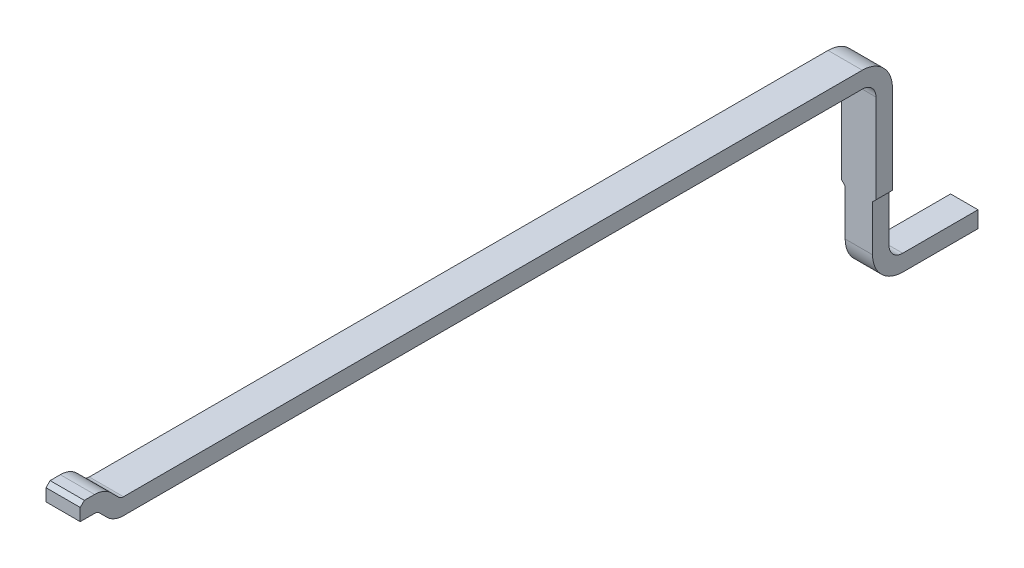
ISO-10303-21;
HEADER;
FILE_DESCRIPTION(('STEP AP214'),'2;1');
FILE_NAME('part.step','',(''),(''),'','','');
FILE_SCHEMA(('AUTOMOTIVE_DESIGN { 1 0 10303 214 1 1 1 1 }'));
ENDSEC;
DATA;
#1=APPLICATION_CONTEXT('core data for automotive mechanical design processes');
#2=APPLICATION_PROTOCOL_DEFINITION('international standard','automotive_design',2000,#1);
#3=PRODUCT_CONTEXT('',#1,'mechanical');
#4=PRODUCT('Part','Part','',(#3));
#5=PRODUCT_RELATED_PRODUCT_CATEGORY('part','',(#4));
#6=PRODUCT_DEFINITION_FORMATION('','',#4);
#7=PRODUCT_DEFINITION_CONTEXT('part definition',#1,'design');
#8=PRODUCT_DEFINITION('design','',#6,#7);
#9=PRODUCT_DEFINITION_SHAPE('','',#8);
#10=(LENGTH_UNIT() NAMED_UNIT(*) SI_UNIT(.MILLI.,.METRE.));
#11=(NAMED_UNIT(*) PLANE_ANGLE_UNIT() SI_UNIT($,.RADIAN.));
#12=(NAMED_UNIT(*) SI_UNIT($,.STERADIAN.) SOLID_ANGLE_UNIT());
#13=UNCERTAINTY_MEASURE_WITH_UNIT(LENGTH_MEASURE(1.E-05),#10,'distance_accuracy_value','');
#14=(GEOMETRIC_REPRESENTATION_CONTEXT(3) GLOBAL_UNCERTAINTY_ASSIGNED_CONTEXT((#13)) GLOBAL_UNIT_ASSIGNED_CONTEXT((#10,
#11,#12)) REPRESENTATION_CONTEXT('',''));
#15=CARTESIAN_POINT('',(0.,0.,0.));
#16=DIRECTION('',(0.,0.,1.));
#17=DIRECTION('',(1.,0.,0.));
#18=AXIS2_PLACEMENT_3D('',#15,#16,#17);
#19=CARTESIAN_POINT('',(0.,12.81951558355,0.));
#20=DIRECTION('',(0.,-1.,0.));
#21=DIRECTION('',(0.,0.,-1.));
#22=AXIS2_PLACEMENT_3D('',#19,#20,#21);
#23=PLANE('',#22);
#24=DIRECTION('',(0.,0.,-1.));
#25=VECTOR('',#24,1.);
#26=CARTESIAN_POINT('',(16.66210820408,12.81951558355,-5.731698833076));
#27=LINE('',#26,#25);
#28=CARTESIAN_POINT('',(16.6621082033734,12.81951558355,-5.77711513867905));
#29=VERTEX_POINT('',#28);
#30=CARTESIAN_POINT('',(16.6621081743373,12.81951558355,-11.17169883308));
#31=VERTEX_POINT('',#30);
#32=EDGE_CURVE('E450',#29,#31,#27,.T.);
#33=ORIENTED_EDGE('',*,*,#32,.T.);
#34=DIRECTION('',(1.,0.,0.));
#35=VECTOR('',#34,1.);
#36=CARTESIAN_POINT('',(0.,12.81951558355,-11.17169883308));
#37=LINE('',#36,#35);
#38=CARTESIAN_POINT('',(16.9121081743562,12.81951558355,-11.1716988330801));
#39=VERTEX_POINT('',#38);
#40=EDGE_CURVE('E364',#31,#39,#37,.T.);
#41=ORIENTED_EDGE('',*,*,#40,.T.);
#42=DIRECTION('',(0.,0.,-1.));
#43=VECTOR('',#42,1.);
#44=CARTESIAN_POINT('',(16.91210820408,12.81951558355,-12.98169883308));
#45=LINE('',#44,#43);
#46=CARTESIAN_POINT('',(16.9121081940914,12.81951558355,-5.77711513867905));
#47=VERTEX_POINT('',#46);
#48=EDGE_CURVE('E337',#47,#39,#45,.T.);
#49=ORIENTED_EDGE('',*,*,#48,.F.);
#50=DIRECTION('',(-1.,0.,0.));
#51=VECTOR('',#50,1.);
#52=CARTESIAN_POINT('',(0.,12.81951558355,-5.777115138679));
#53=LINE('',#52,#51);
#54=EDGE_CURVE('E42',#47,#29,#53,.T.);
#55=ORIENTED_EDGE('',*,*,#54,.T.);
#56=EDGE_LOOP('',(#33,#41,#49,#55));
#57=FACE_BOUND('',#56,.T.);
#58=ADVANCED_FACE('F17',(#57),#23,.T.);
#59=CARTESIAN_POINT('',(12.51210817501,12.93951558355,-11.38169883308));
#60=DIRECTION('',(0.,-1.,0.));
#61=DIRECTION('',(0.,0.,-1.));
#62=AXIS2_PLACEMENT_3D('',#59,#60,#61);
#63=PLANE('',#62);
#64=DIRECTION('',(0.,0.,-1.));
#65=VECTOR('',#64,1.);
#66=CARTESIAN_POINT('',(16.66210820408,12.93951558355,-11.38169883308));
#67=LINE('',#66,#65);
#68=CARTESIAN_POINT('',(16.6621082033734,12.93951558355,-5.77711513867901));
#69=VERTEX_POINT('',#68);
#70=CARTESIAN_POINT('',(16.6621081743373,12.93951558355,-11.17169883308));
#71=VERTEX_POINT('',#70);
#72=EDGE_CURVE('E451',#69,#71,#67,.T.);
#73=ORIENTED_EDGE('',*,*,#72,.F.);
#74=DIRECTION('',(-1.,0.,0.));
#75=VECTOR('',#74,1.);
#76=CARTESIAN_POINT('',(12.51210817501,12.93951558355,-5.777115138679));
#77=LINE('',#76,#75);
#78=CARTESIAN_POINT('',(16.9121082033735,12.93951558355,-5.77711513867901));
#79=VERTEX_POINT('',#78);
#80=EDGE_CURVE('E11',#79,#69,#77,.T.);
#81=ORIENTED_EDGE('',*,*,#80,.F.);
#82=DIRECTION('',(0.,0.,1.));
#83=VECTOR('',#82,1.);
#84=CARTESIAN_POINT('',(16.91210820408,12.93951558355,-12.98169883308));
#85=LINE('',#84,#83);
#86=CARTESIAN_POINT('',(16.9121081743562,12.93951558355,-11.17169883308));
#87=VERTEX_POINT('',#86);
#88=EDGE_CURVE('E480',#87,#79,#85,.T.);
#89=ORIENTED_EDGE('',*,*,#88,.F.);
#90=DIRECTION('',(-1.,0.,0.));
#91=VECTOR('',#90,1.);
#92=CARTESIAN_POINT('',(13.11210817501,12.93951558355,-11.17169883308));
#93=LINE('',#92,#91);
#94=EDGE_CURVE('E75',#87,#71,#93,.T.);
#95=ORIENTED_EDGE('',*,*,#94,.T.);
#96=EDGE_LOOP('',(#73,#81,#89,#95));
#97=FACE_BOUND('',#96,.T.);
#98=ADVANCED_FACE('F1022',(#97),#63,.F.);
#99=CARTESIAN_POINT('',(12.51210817501,12.98951558355,-5.777115138679));
#100=DIRECTION('',(1.,0.,0.));
#101=DIRECTION('',(0.,0.,1.));
#102=AXIS2_PLACEMENT_3D('',#99,#100,#101);
#103=CYLINDRICAL_SURFACE('',#102,0.05);
#104=ORIENTED_EDGE('',*,*,#80,.T.);
#105=CARTESIAN_POINT('',(16.66210820408,12.98951558355,-5.777115138679));
#106=DIRECTION('',(-1.,0.,0.));
#107=DIRECTION('',(0.,0.,1.));
#108=AXIS2_PLACEMENT_3D('',#105,#106,#107);
#109=CIRCLE('',#108,0.05);
#110=CARTESIAN_POINT('',(16.6621082033734,12.9541602444904,-5.74175979962039));
#111=VERTEX_POINT('',#110);
#112=EDGE_CURVE('E301',#69,#111,#109,.T.);
#113=ORIENTED_EDGE('',*,*,#112,.T.);
#114=DIRECTION('',(-1.,0.,0.));
#115=VECTOR('',#114,1.);
#116=CARTESIAN_POINT('',(16.91210820408,12.954160244491,-5.741759799621));
#117=LINE('',#116,#115);
#118=CARTESIAN_POINT('',(16.9121082033734,12.9541602444904,-5.74175979962039));
#119=VERTEX_POINT('',#118);
#120=EDGE_CURVE('E28',#119,#111,#117,.T.);
#121=ORIENTED_EDGE('',*,*,#120,.F.);
#122=CARTESIAN_POINT('',(16.91210820408,12.98951558355,-5.777115138679));
#123=DIRECTION('',(-1.,0.,0.));
#124=DIRECTION('',(0.,0.,1.));
#125=AXIS2_PLACEMENT_3D('',#122,#123,#124);
#126=CIRCLE('',#125,0.05);
#127=EDGE_CURVE('E344',#79,#119,#126,.T.);
#128=ORIENTED_EDGE('',*,*,#127,.F.);
#129=EDGE_LOOP('',(#104,#113,#121,#128));
#130=FACE_BOUND('',#129,.T.);
#131=ADVANCED_FACE('F19',(#130),#103,.F.);
#132=CARTESIAN_POINT('',(16.91210820408,12.93951558355,-5.756404460561));
#133=DIRECTION('',(0.,0.707106781186548,-0.707106781186548));
#134=DIRECTION('',(-1.,0.,0.));
#135=AXIS2_PLACEMENT_3D('',#132,#133,#134);
#136=PLANE('',#135);
#137=DIRECTION('',(-1.,0.,0.));
#138=VECTOR('',#137,1.);
#139=CARTESIAN_POINT('',(16.91210820408,13.009723736351,-5.68619630776));
#140=LINE('',#139,#138);
#141=CARTESIAN_POINT('',(16.9121082033734,13.0097237363508,-5.68619630775937));
#142=VERTEX_POINT('',#141);
#143=CARTESIAN_POINT('',(16.6621082033734,13.0097237363508,-5.68619630775937));
#144=VERTEX_POINT('',#143);
#145=EDGE_CURVE('E394',#142,#144,#140,.T.);
#146=ORIENTED_EDGE('',*,*,#145,.F.);
#147=DIRECTION('',(0.,0.707106781180048,0.707106781193047));
#148=VECTOR('',#147,1.);
#149=CARTESIAN_POINT('',(16.91210820408,12.95416024449,-5.74175979962));
#150=LINE('',#149,#148);
#151=EDGE_CURVE('E336',#119,#142,#150,.T.);
#152=ORIENTED_EDGE('',*,*,#151,.F.);
#153=ORIENTED_EDGE('',*,*,#120,.T.);
#154=DIRECTION('',(0.,0.707106781180048,0.707106781193047));
#155=VECTOR('',#154,1.);
#156=CARTESIAN_POINT('',(16.66210820408,12.95416024449,-5.74175979962));
#157=LINE('',#156,#155);
#158=EDGE_CURVE('E349',#111,#144,#157,.T.);
#159=ORIENTED_EDGE('',*,*,#158,.T.);
#160=EDGE_LOOP('',(#146,#152,#153,#159));
#161=FACE_BOUND('',#160,.T.);
#162=ADVANCED_FACE('F588',(#161),#136,.T.);
#163=CARTESIAN_POINT('',(16.91210820408,12.88951558355,-5.565988154957));
#164=DIRECTION('',(1.,0.,0.));
#165=DIRECTION('',(0.,0.,1.));
#166=AXIS2_PLACEMENT_3D('',#163,#164,#165);
#167=CYLINDRICAL_SURFACE('',#166,0.17);
#168=DIRECTION('',(-1.,0.,0.));
#169=VECTOR('',#168,1.);
#170=CARTESIAN_POINT('',(16.91210820408,13.05951558355,-5.565988154957));
#171=LINE('',#170,#169);
#172=CARTESIAN_POINT('',(16.9121082033735,13.05951558355,-5.565988154957));
#173=VERTEX_POINT('',#172);
#174=CARTESIAN_POINT('',(16.6621082033734,13.05951558355,-5.565988154957));
#175=VERTEX_POINT('',#174);
#176=EDGE_CURVE('E439',#173,#175,#171,.T.);
#177=ORIENTED_EDGE('',*,*,#176,.F.);
#178=CARTESIAN_POINT('',(16.91210820408,12.88951558355,-5.565988154957));
#179=DIRECTION('',(1.,0.,0.));
#180=DIRECTION('',(0.,0.,1.));
#181=AXIS2_PLACEMENT_3D('',#178,#179,#180);
#182=CIRCLE('',#181,0.17);
#183=EDGE_CURVE('E331',#142,#173,#182,.T.);
#184=ORIENTED_EDGE('',*,*,#183,.F.);
#185=ORIENTED_EDGE('',*,*,#145,.T.);
#186=CARTESIAN_POINT('',(16.66210820408,12.88951558355,-5.565988154957));
#187=DIRECTION('',(1.,0.,0.));
#188=DIRECTION('',(0.,0.,1.));
#189=AXIS2_PLACEMENT_3D('',#186,#187,#188);
#190=CIRCLE('',#189,0.17);
#191=EDGE_CURVE('E353',#144,#175,#190,.T.);
#192=ORIENTED_EDGE('',*,*,#191,.T.);
#193=EDGE_LOOP('',(#177,#184,#185,#192));
#194=FACE_BOUND('',#193,.T.);
#195=ADVANCED_FACE('F582',(#194),#167,.T.);
#196=CARTESIAN_POINT('',(16.91210820408,13.05951558355,-5.661404460561));
#197=DIRECTION('',(0.,1.,0.));
#198=DIRECTION('',(1.,0.,0.));
#199=AXIS2_PLACEMENT_3D('',#196,#197,#198);
#200=PLANE('',#199);
#201=ORIENTED_EDGE('',*,*,#176,.T.);
#202=DIRECTION('',(0.,0.,1.));
#203=VECTOR('',#202,1.);
#204=CARTESIAN_POINT('',(16.66210820408,13.05951558355,-5.731698833076));
#205=LINE('',#204,#203);
#206=CARTESIAN_POINT('',(16.6621082033734,13.05951558355,-5.491404460561));
#207=VERTEX_POINT('',#206);
#208=EDGE_CURVE('E377',#175,#207,#205,.T.);
#209=ORIENTED_EDGE('',*,*,#208,.T.);
#210=DIRECTION('',(1.,0.,0.));
#211=VECTOR('',#210,1.);
#212=CARTESIAN_POINT('',(16.91210820408,13.05951558355,-5.491404460561));
#213=LINE('',#212,#211);
#214=CARTESIAN_POINT('',(16.9121082033735,13.05951558355,-5.491404460561));
#215=VERTEX_POINT('',#214);
#216=EDGE_CURVE('E436',#207,#215,#213,.T.);
#217=ORIENTED_EDGE('',*,*,#216,.T.);
#218=DIRECTION('',(0.,0.,1.));
#219=VECTOR('',#218,1.);
#220=CARTESIAN_POINT('',(16.91210820408,13.05951558355,-12.98169883308));
#221=LINE('',#220,#219);
#222=EDGE_CURVE('E335',#173,#215,#221,.T.);
#223=ORIENTED_EDGE('',*,*,#222,.F.);
#224=EDGE_LOOP('',(#201,#209,#217,#223));
#225=FACE_BOUND('',#224,.T.);
#226=ADVANCED_FACE('F578',(#225),#200,.T.);
#227=CARTESIAN_POINT('',(16.91210820408,13.02951558355,-5.461404460561));
#228=DIRECTION('',(0.,-0.707106781187048,-0.707106781186048));
#229=DIRECTION('',(0.,0.707106781186048,-0.707106781187048));
#230=AXIS2_PLACEMENT_3D('',#227,#228,#229);
#231=PLANE('',#230);
#232=ORIENTED_EDGE('',*,*,#216,.F.);
#233=DIRECTION('',(0.,-0.707106781186548,0.707106781186548));
#234=VECTOR('',#233,1.);
#235=CARTESIAN_POINT('',(16.66210820408,13.05951558355,-5.491404460561));
#236=LINE('',#235,#234);
#237=CARTESIAN_POINT('',(16.6621082033734,13.02951558355,-5.461404460561));
#238=VERTEX_POINT('',#237);
#239=EDGE_CURVE('E381',#207,#238,#236,.T.);
#240=ORIENTED_EDGE('',*,*,#239,.T.);
#241=DIRECTION('',(-1.,0.,0.));
#242=VECTOR('',#241,1.);
#243=CARTESIAN_POINT('',(16.91210820408,13.02951558355,-5.461404460561));
#244=LINE('',#243,#242);
#245=CARTESIAN_POINT('',(16.9121082033734,13.02951558355,-5.461404460561));
#246=VERTEX_POINT('',#245);
#247=EDGE_CURVE('E360',#246,#238,#244,.T.);
#248=ORIENTED_EDGE('',*,*,#247,.F.);
#249=DIRECTION('',(0.,-0.707106781186548,0.707106781186548));
#250=VECTOR('',#249,1.);
#251=CARTESIAN_POINT('',(16.91210820408,13.05951558355,-5.491404460561));
#252=LINE('',#251,#250);
#253=EDGE_CURVE('E400',#215,#246,#252,.T.);
#254=ORIENTED_EDGE('',*,*,#253,.F.);
#255=EDGE_LOOP('',(#232,#240,#248,#254));
#256=FACE_BOUND('',#255,.T.);
#257=ADVANCED_FACE('F562',(#256),#231,.F.);
#258=CARTESIAN_POINT('',(16.91210820408,13.05951558355,-5.461404460561));
#259=DIRECTION('',(0.,0.,1.));
#260=DIRECTION('',(1.,0.,0.));
#261=AXIS2_PLACEMENT_3D('',#258,#259,#260);
#262=PLANE('',#261);
#263=DIRECTION('',(1.,0.,0.));
#264=VECTOR('',#263,1.);
#265=CARTESIAN_POINT('',(17.5653424523,12.93951558355,-5.461404460561));
#266=LINE('',#265,#264);
#267=CARTESIAN_POINT('',(16.6621082033734,12.93951558355,-5.461404460561));
#268=VERTEX_POINT('',#267);
#269=CARTESIAN_POINT('',(16.9121082033735,12.93951558355,-5.461404460561));
#270=VERTEX_POINT('',#269);
#271=EDGE_CURVE('E357',#268,#270,#266,.T.);
#272=ORIENTED_EDGE('',*,*,#271,.T.);
#273=DIRECTION('',(0.,-1.,0.));
#274=VECTOR('',#273,1.);
#275=CARTESIAN_POINT('',(16.91210820408,12.65951558355,-5.461404460561));
#276=LINE('',#275,#274);
#277=EDGE_CURVE('E404',#246,#270,#276,.T.);
#278=ORIENTED_EDGE('',*,*,#277,.F.);
#279=ORIENTED_EDGE('',*,*,#247,.T.);
#280=DIRECTION('',(0.,-1.,0.));
#281=VECTOR('',#280,1.);
#282=CARTESIAN_POINT('',(16.66210820408,12.93951558355,-5.461404460561));
#283=LINE('',#282,#281);
#284=EDGE_CURVE('E369',#238,#268,#283,.T.);
#285=ORIENTED_EDGE('',*,*,#284,.T.);
#286=EDGE_LOOP('',(#272,#278,#279,#285));
#287=FACE_BOUND('',#286,.T.);
#288=ADVANCED_FACE('F556',(#287),#262,.T.);
#289=CARTESIAN_POINT('',(17.5653424523,12.93951558355,-5.535988154957));
#290=DIRECTION('',(0.,1.,-1.444831928366E-13));
#291=DIRECTION('',(0.,-1.444831928366E-13,-1.));
#292=AXIS2_PLACEMENT_3D('',#289,#290,#291);
#293=PLANE('',#292);
#294=DIRECTION('',(0.,0.,-1.));
#295=VECTOR('',#294,1.);
#296=CARTESIAN_POINT('',(16.91210820408,12.93951558355,-12.98169883308));
#297=LINE('',#296,#295);
#298=CARTESIAN_POINT('',(16.9121082033735,12.93951558355,-5.565988154957));
#299=VERTEX_POINT('',#298);
#300=EDGE_CURVE('E399',#270,#299,#297,.T.);
#301=ORIENTED_EDGE('',*,*,#300,.F.);
#302=ORIENTED_EDGE('',*,*,#271,.F.);
#303=DIRECTION('',(0.,0.,-1.));
#304=VECTOR('',#303,1.);
#305=CARTESIAN_POINT('',(16.66210820408,12.93951558355,-5.731698833076));
#306=LINE('',#305,#304);
#307=CARTESIAN_POINT('',(16.6621082033734,12.93951558355,-5.565988154957));
#308=VERTEX_POINT('',#307);
#309=EDGE_CURVE('E365',#268,#308,#306,.T.);
#310=ORIENTED_EDGE('',*,*,#309,.T.);
#311=DIRECTION('',(1.,0.,0.));
#312=VECTOR('',#311,1.);
#313=CARTESIAN_POINT('',(17.5653424523,12.93951558355,-5.565988154957));
#314=LINE('',#313,#312);
#315=EDGE_CURVE('E361',#308,#299,#314,.T.);
#316=ORIENTED_EDGE('',*,*,#315,.T.);
#317=EDGE_LOOP('',(#301,#302,#310,#316));
#318=FACE_BOUND('',#317,.T.);
#319=ADVANCED_FACE('F567',(#318),#293,.F.);
#320=CARTESIAN_POINT('',(17.5653424523,12.88951558355,-5.565988154957));
#321=DIRECTION('',(-1.,0.,0.));
#322=DIRECTION('',(0.,0.,-1.));
#323=AXIS2_PLACEMENT_3D('',#320,#321,#322);
#324=CYLINDRICAL_SURFACE('',#323,0.05);
#325=DIRECTION('',(-1.,0.,0.));
#326=VECTOR('',#325,1.);
#327=CARTESIAN_POINT('',(16.91210820408,12.92487092261,-5.601343494017));
#328=LINE('',#327,#326);
#329=CARTESIAN_POINT('',(16.9121082033734,12.9248709226098,-5.60134349401678));
#330=VERTEX_POINT('',#329);
#331=CARTESIAN_POINT('',(16.6621082033734,12.9248709226098,-5.60134349401678));
#332=VERTEX_POINT('',#331);
#333=EDGE_CURVE('E391',#330,#332,#328,.T.);
#334=ORIENTED_EDGE('',*,*,#333,.F.);
#335=CARTESIAN_POINT('',(16.91210820408,12.88951558355,-5.565988154957));
#336=DIRECTION('',(-1.,0.,0.));
#337=DIRECTION('',(0.,0.,-1.));
#338=AXIS2_PLACEMENT_3D('',#335,#336,#337);
#339=CIRCLE('',#338,0.05);
#340=EDGE_CURVE('E395',#299,#330,#339,.T.);
#341=ORIENTED_EDGE('',*,*,#340,.F.);
#342=ORIENTED_EDGE('',*,*,#315,.F.);
#343=CARTESIAN_POINT('',(16.66210820408,12.88951558355,-5.565988154957));
#344=DIRECTION('',(-1.,0.,0.));
#345=DIRECTION('',(0.,0.,-1.));
#346=AXIS2_PLACEMENT_3D('',#343,#344,#345);
#347=CIRCLE('',#346,0.05);
#348=EDGE_CURVE('E370',#308,#332,#347,.T.);
#349=ORIENTED_EDGE('',*,*,#348,.T.);
#350=EDGE_LOOP('',(#334,#341,#342,#349));
#351=FACE_BOUND('',#350,.T.);
#352=ADVANCED_FACE('F571',(#351),#324,.F.);
#353=CARTESIAN_POINT('',(16.91210820408,12.93951558355,-5.586698833076));
#354=DIRECTION('',(0.,-0.707106781186048,0.707106781187048));
#355=DIRECTION('',(-1.,0.,0.));
#356=AXIS2_PLACEMENT_3D('',#353,#354,#355);
#357=PLANE('',#356);
#358=ORIENTED_EDGE('',*,*,#333,.T.);
#359=DIRECTION('',(0.,-0.707106781180048,-0.707106781193047));
#360=VECTOR('',#359,1.);
#361=CARTESIAN_POINT('',(16.66210820408,12.92487092261,-5.601343494017));
#362=LINE('',#361,#360);
#363=CARTESIAN_POINT('',(16.6621082033734,12.8693074307492,-5.65690698587737));
#364=VERTEX_POINT('',#363);
#365=EDGE_CURVE('E405',#332,#364,#362,.T.);
#366=ORIENTED_EDGE('',*,*,#365,.T.);
#367=DIRECTION('',(-1.,0.,0.));
#368=VECTOR('',#367,1.);
#369=CARTESIAN_POINT('',(13.06210817501,12.869307430749,-5.656906985877));
#370=LINE('',#369,#368);
#371=CARTESIAN_POINT('',(16.9121081940914,12.8693074307491,-5.65690698587741));
#372=VERTEX_POINT('',#371);
#373=EDGE_CURVE('E388',#372,#364,#370,.T.);
#374=ORIENTED_EDGE('',*,*,#373,.F.);
#375=DIRECTION('',(0.,-0.707106781180048,-0.707106781193047));
#376=VECTOR('',#375,1.);
#377=CARTESIAN_POINT('',(16.91210820408,12.92487092261,-5.601343494017));
#378=LINE('',#377,#376);
#379=EDGE_CURVE('E375',#330,#372,#378,.T.);
#380=ORIENTED_EDGE('',*,*,#379,.F.);
#381=EDGE_LOOP('',(#358,#366,#374,#380));
#382=FACE_BOUND('',#381,.T.);
#383=ADVANCED_FACE('F955',(#382),#357,.T.);
#384=CARTESIAN_POINT('',(13.06210817501,12.98951558355,-5.777115138679));
#385=DIRECTION('',(1.,0.,0.));
#386=DIRECTION('',(0.,0.,1.));
#387=AXIS2_PLACEMENT_3D('',#384,#385,#386);
#388=CYLINDRICAL_SURFACE('',#387,0.17);
#389=ORIENTED_EDGE('',*,*,#54,.F.);
#390=CARTESIAN_POINT('',(16.91210818449,12.98951558355,-5.777115138679));
#391=DIRECTION('',(1.,0.,0.));
#392=DIRECTION('',(0.,0.,1.));
#393=AXIS2_PLACEMENT_3D('',#390,#391,#392);
#394=CIRCLE('',#393,0.17);
#395=EDGE_CURVE('E340',#372,#47,#394,.T.);
#396=ORIENTED_EDGE('',*,*,#395,.F.);
#397=ORIENTED_EDGE('',*,*,#373,.T.);
#398=CARTESIAN_POINT('',(16.66210820408,12.98951558355,-5.777115138679));
#399=DIRECTION('',(1.,0.,0.));
#400=DIRECTION('',(0.,0.,1.));
#401=AXIS2_PLACEMENT_3D('',#398,#399,#400);
#402=CIRCLE('',#401,0.17);
#403=EDGE_CURVE('E409',#364,#29,#402,.T.);
#404=ORIENTED_EDGE('',*,*,#403,.T.);
#405=EDGE_LOOP('',(#389,#396,#397,#404));
#406=FACE_BOUND('',#405,.T.);
#407=ADVANCED_FACE('F946',(#406),#388,.T.);
#408=CARTESIAN_POINT('',(12.81210814532,12.71951558355,-11.17169883308));
#409=DIRECTION('',(1.,0.,0.));
#410=DIRECTION('',(0.,0.,1.));
#411=AXIS2_PLACEMENT_3D('',#408,#409,#410);
#412=CYLINDRICAL_SURFACE('',#411,0.22);
#413=ORIENTED_EDGE('',*,*,#94,.F.);
#414=CARTESIAN_POINT('',(16.91210814532,12.71951558355,-11.17169883308));
#415=DIRECTION('',(-1.,0.,0.));
#416=DIRECTION('',(0.,0.,1.));
#417=AXIS2_PLACEMENT_3D('',#414,#415,#416);
#418=CIRCLE('',#417,0.22);
#419=CARTESIAN_POINT('',(16.91210814532,12.71951558355,-11.39169883308));
#420=VERTEX_POINT('',#419);
#421=EDGE_CURVE('E486',#87,#420,#418,.T.);
#422=ORIENTED_EDGE('',*,*,#421,.T.);
#423=DIRECTION('',(-1.,0.,0.));
#424=VECTOR('',#423,1.);
#425=CARTESIAN_POINT('',(12.81210814532,12.71951558355,-11.39169883308));
#426=LINE('',#425,#424);
#427=CARTESIAN_POINT('',(16.66210814532,12.71951558355,-11.39169883308));
#428=VERTEX_POINT('',#427);
#429=EDGE_CURVE('E308',#420,#428,#426,.T.);
#430=ORIENTED_EDGE('',*,*,#429,.T.);
#431=CARTESIAN_POINT('',(16.66210814532,12.71951558355,-11.17169883308));
#432=DIRECTION('',(-1.,0.,0.));
#433=DIRECTION('',(0.,0.,1.));
#434=AXIS2_PLACEMENT_3D('',#431,#432,#433);
#435=CIRCLE('',#434,0.22);
#436=EDGE_CURVE('E164',#71,#428,#435,.T.);
#437=ORIENTED_EDGE('',*,*,#436,.F.);
#438=EDGE_LOOP('',(#413,#422,#430,#437));
#439=FACE_BOUND('',#438,.T.);
#440=ADVANCED_FACE('F938',(#439),#412,.T.);
#441=CARTESIAN_POINT('',(16.91210814532,12.93951558355,-11.91169883308));
#442=DIRECTION('',(1.,0.,0.));
#443=DIRECTION('',(0.,0.,-1.));
#444=AXIS2_PLACEMENT_3D('',#441,#442,#443);
#445=PLANE('',#444);
#446=ORIENTED_EDGE('',*,*,#421,.F.);
#447=ORIENTED_EDGE('',*,*,#88,.T.);
#448=ORIENTED_EDGE('',*,*,#127,.T.);
#449=ORIENTED_EDGE('',*,*,#151,.T.);
#450=ORIENTED_EDGE('',*,*,#183,.T.);
#451=ORIENTED_EDGE('',*,*,#222,.T.);
#452=ORIENTED_EDGE('',*,*,#253,.T.);
#453=ORIENTED_EDGE('',*,*,#277,.T.);
#454=ORIENTED_EDGE('',*,*,#300,.T.);
#455=ORIENTED_EDGE('',*,*,#340,.T.);
#456=ORIENTED_EDGE('',*,*,#379,.T.);
#457=ORIENTED_EDGE('',*,*,#395,.T.);
#458=ORIENTED_EDGE('',*,*,#48,.T.);
#459=CARTESIAN_POINT('',(16.91210814532,12.71951558355,-11.17169883308));
#460=DIRECTION('',(-1.,0.,0.));
#461=DIRECTION('',(0.,0.,-1.));
#462=AXIS2_PLACEMENT_3D('',#459,#460,#461);
#463=CIRCLE('',#462,0.1);
#464=CARTESIAN_POINT('',(16.91210814532,12.71951558355,-11.27169883308));
#465=VERTEX_POINT('',#464);
#466=EDGE_CURVE('E329',#39,#465,#463,.T.);
#467=ORIENTED_EDGE('',*,*,#466,.T.);
#468=DIRECTION('',(0.,-1.,0.));
#469=VECTOR('',#468,1.);
#470=CARTESIAN_POINT('',(16.91210814532,12.93951558355,-11.27169883308));
#471=LINE('',#470,#469);
#472=CARTESIAN_POINT('',(16.91210814532,12.06951558355,-11.27169883308));
#473=VERTEX_POINT('',#472);
#474=EDGE_CURVE('E330',#465,#473,#471,.T.);
#475=ORIENTED_EDGE('',*,*,#474,.T.);
#476=DIRECTION('',(0.,0.,-1.));
#477=VECTOR('',#476,1.);
#478=CARTESIAN_POINT('',(16.91210814532,12.06951558355,-11.91169883308));
#479=LINE('',#478,#477);
#480=CARTESIAN_POINT('',(16.91210814532,12.06951558355,-11.39169883308));
#481=VERTEX_POINT('',#480);
#482=EDGE_CURVE('E345',#473,#481,#479,.T.);
#483=ORIENTED_EDGE('',*,*,#482,.T.);
#484=DIRECTION('',(0.,1.,0.));
#485=VECTOR('',#484,1.);
#486=CARTESIAN_POINT('',(16.91210814532,12.93951558355,-11.39169883308));
#487=LINE('',#486,#485);
#488=EDGE_CURVE('E303',#481,#420,#487,.T.);
#489=ORIENTED_EDGE('',*,*,#488,.T.);
#490=EDGE_LOOP('',(#446,#447,#448,#449,#450,#451,#452,#453,#454,#455,#456,#457,#458,#467,#475,
#483,#489));
#491=FACE_BOUND('',#490,.T.);
#492=ADVANCED_FACE('F574',(#491),#445,.T.);
#493=CARTESIAN_POINT('',(16.66210814532,12.93951558355,-10.71169883308));
#494=DIRECTION('',(-1.,0.,0.));
#495=DIRECTION('',(0.,1.,0.));
#496=AXIS2_PLACEMENT_3D('',#493,#494,#495);
#497=PLANE('',#496);
#498=ORIENTED_EDGE('',*,*,#72,.T.);
#499=ORIENTED_EDGE('',*,*,#436,.T.);
#500=DIRECTION('',(0.,-1.,0.));
#501=VECTOR('',#500,1.);
#502=CARTESIAN_POINT('',(16.66210814532,12.93951558355,-11.39169883308));
#503=LINE('',#502,#501);
#504=CARTESIAN_POINT('',(16.66210814532,12.06951558355,-11.39169883308));
#505=VERTEX_POINT('',#504);
#506=EDGE_CURVE('E462',#428,#505,#503,.T.);
#507=ORIENTED_EDGE('',*,*,#506,.T.);
#508=DIRECTION('',(0.,0.,1.));
#509=VECTOR('',#508,1.);
#510=CARTESIAN_POINT('',(16.66210814532,12.06951558355,-10.71169883308));
#511=LINE('',#510,#509);
#512=CARTESIAN_POINT('',(16.66210814532,12.06951558355,-11.27169883308));
#513=VERTEX_POINT('',#512);
#514=EDGE_CURVE('E319',#505,#513,#511,.T.);
#515=ORIENTED_EDGE('',*,*,#514,.T.);
#516=DIRECTION('',(0.,1.,0.));
#517=VECTOR('',#516,1.);
#518=CARTESIAN_POINT('',(16.66210814532,12.93951558355,-11.27169883308));
#519=LINE('',#518,#517);
#520=CARTESIAN_POINT('',(16.66210814532,12.71951558355,-11.27169883308));
#521=VERTEX_POINT('',#520);
#522=EDGE_CURVE('E179',#513,#521,#519,.T.);
#523=ORIENTED_EDGE('',*,*,#522,.T.);
#524=CARTESIAN_POINT('',(16.66210814532,12.71951558355,-11.17169883308));
#525=DIRECTION('',(1.,0.,0.));
#526=DIRECTION('',(0.,0.,-1.));
#527=AXIS2_PLACEMENT_3D('',#524,#525,#526);
#528=CIRCLE('',#527,0.1);
#529=EDGE_CURVE('E325',#521,#31,#528,.T.);
#530=ORIENTED_EDGE('',*,*,#529,.T.);
#531=ORIENTED_EDGE('',*,*,#32,.F.);
#532=ORIENTED_EDGE('',*,*,#403,.F.);
#533=ORIENTED_EDGE('',*,*,#365,.F.);
#534=ORIENTED_EDGE('',*,*,#348,.F.);
#535=ORIENTED_EDGE('',*,*,#309,.F.);
#536=ORIENTED_EDGE('',*,*,#284,.F.);
#537=ORIENTED_EDGE('',*,*,#239,.F.);
#538=ORIENTED_EDGE('',*,*,#208,.F.);
#539=ORIENTED_EDGE('',*,*,#191,.F.);
#540=ORIENTED_EDGE('',*,*,#158,.F.);
#541=ORIENTED_EDGE('',*,*,#112,.F.);
#542=EDGE_LOOP('',(#498,#499,#507,#515,#523,#530,#531,#532,#533,#534,#535,#536,#537,#538,#539,
#540,#541));
#543=FACE_BOUND('',#542,.T.);
#544=ADVANCED_FACE('F498',(#543),#497,.T.);
#545=CARTESIAN_POINT('',(19.01210814532,12.71951558355,-11.17169883308));
#546=DIRECTION('',(-1.,0.,0.));
#547=DIRECTION('',(0.,0.,-1.));
#548=AXIS2_PLACEMENT_3D('',#545,#546,#547);
#549=CYLINDRICAL_SURFACE('',#548,0.1);
#550=ORIENTED_EDGE('',*,*,#529,.F.);
#551=DIRECTION('',(-1.,0.,0.));
#552=VECTOR('',#551,1.);
#553=CARTESIAN_POINT('',(19.01210814532,12.71951558355,-11.27169883308));
#554=LINE('',#553,#552);
#555=EDGE_CURVE('E354',#465,#521,#554,.T.);
#556=ORIENTED_EDGE('',*,*,#555,.F.);
#557=ORIENTED_EDGE('',*,*,#466,.F.);
#558=ORIENTED_EDGE('',*,*,#40,.F.);
#559=EDGE_LOOP('',(#550,#556,#557,#558));
#560=FACE_BOUND('',#559,.T.);
#561=ADVANCED_FACE('F508',(#560),#549,.F.);
#562=CARTESIAN_POINT('',(16.66210814532,11.48951558355,-11.27169883308));
#563=DIRECTION('',(0.,0.,1.));
#564=DIRECTION('',(1.,0.,0.));
#565=AXIS2_PLACEMENT_3D('',#562,#563,#564);
#566=PLANE('',#565);
#567=ORIENTED_EDGE('',*,*,#555,.T.);
#568=ORIENTED_EDGE('',*,*,#522,.F.);
#569=DIRECTION('',(0.707106781186548,-0.707106781186548,0.));
#570=VECTOR('',#569,1.);
#571=CARTESIAN_POINT('',(16.66210814532,12.06951558355,-11.27169883308));
#572=LINE('',#571,#570);
#573=CARTESIAN_POINT('',(16.68710814532,12.04451558355,-11.27169883308));
#574=VERTEX_POINT('',#573);
#575=EDGE_CURVE('E318',#513,#574,#572,.T.);
#576=ORIENTED_EDGE('',*,*,#575,.T.);
#577=DIRECTION('',(0.,-1.,0.));
#578=VECTOR('',#577,1.);
#579=CARTESIAN_POINT('',(16.68710814532,11.48951558355,-11.27169883308));
#580=LINE('',#579,#578);
#581=CARTESIAN_POINT('',(16.68710814532,11.70951558355,-11.27169883308));
#582=VERTEX_POINT('',#581);
#583=EDGE_CURVE('E314',#574,#582,#580,.T.);
#584=ORIENTED_EDGE('',*,*,#583,.T.);
#585=DIRECTION('',(1.,0.,0.));
#586=VECTOR('',#585,1.);
#587=CARTESIAN_POINT('',(16.66210814532,11.70951558355,-11.27169883308));
#588=LINE('',#587,#586);
#589=CARTESIAN_POINT('',(16.88710814532,11.70951558355,-11.27169883308));
#590=VERTEX_POINT('',#589);
#591=EDGE_CURVE('E275',#582,#590,#588,.T.);
#592=ORIENTED_EDGE('',*,*,#591,.T.);
#593=DIRECTION('',(0.,1.,0.));
#594=VECTOR('',#593,1.);
#595=CARTESIAN_POINT('',(16.88710814532,11.48951558355,-11.27169883308));
#596=LINE('',#595,#594);
#597=CARTESIAN_POINT('',(16.88710814532,12.04451558355,-11.27169883308));
#598=VERTEX_POINT('',#597);
#599=EDGE_CURVE('E271',#590,#598,#596,.T.);
#600=ORIENTED_EDGE('',*,*,#599,.T.);
#601=DIRECTION('',(0.707106781186548,0.707106781186548,0.));
#602=VECTOR('',#601,1.);
#603=CARTESIAN_POINT('',(16.88710814532,12.04451558355,-11.27169883308));
#604=LINE('',#603,#602);
#605=EDGE_CURVE('E348',#598,#473,#604,.T.);
#606=ORIENTED_EDGE('',*,*,#605,.T.);
#607=ORIENTED_EDGE('',*,*,#474,.F.);
#608=EDGE_LOOP('',(#567,#568,#576,#584,#592,#600,#606,#607));
#609=FACE_BOUND('',#608,.T.);
#610=ADVANCED_FACE('F505',(#609),#566,.T.);
#611=CARTESIAN_POINT('',(16.88210814532,12.03951558355,-8.041698833076));
#612=DIRECTION('',(-0.707106781186048,0.707106781187048,0.));
#613=DIRECTION('',(0.,0.,1.));
#614=AXIS2_PLACEMENT_3D('',#611,#612,#613);
#615=PLANE('',#614);
#616=DIRECTION('',(0.707106781186548,0.707106781186548,0.));
#617=VECTOR('',#616,1.);
#618=CARTESIAN_POINT('',(16.88710814532,12.04451558355,-11.39169883308));
#619=LINE('',#618,#617);
#620=CARTESIAN_POINT('',(16.88710814532,12.04451558355,-11.39169883308));
#621=VERTEX_POINT('',#620);
#622=EDGE_CURVE('E307',#621,#481,#619,.T.);
#623=ORIENTED_EDGE('',*,*,#622,.T.);
#624=ORIENTED_EDGE('',*,*,#482,.F.);
#625=ORIENTED_EDGE('',*,*,#605,.F.);
#626=DIRECTION('',(0.,0.,1.));
#627=VECTOR('',#626,1.);
#628=CARTESIAN_POINT('',(16.88710814532,12.04451558355,-8.041698833076));
#629=LINE('',#628,#627);
#630=EDGE_CURVE('E386',#621,#598,#629,.T.);
#631=ORIENTED_EDGE('',*,*,#630,.F.);
#632=EDGE_LOOP('',(#623,#624,#625,#631));
#633=FACE_BOUND('',#632,.T.);
#634=ADVANCED_FACE('F897',(#633),#615,.F.);
#635=CARTESIAN_POINT('',(12.81210814532,12.93951558355,-11.39169883308));
#636=DIRECTION('',(0.,0.,1.));
#637=DIRECTION('',(1.,0.,0.));
#638=AXIS2_PLACEMENT_3D('',#635,#636,#637);
#639=PLANE('',#638);
#640=DIRECTION('',(0.707106781186048,-0.707106781187048,0.));
#641=VECTOR('',#640,1.);
#642=CARTESIAN_POINT('',(16.66210814532,12.06951558355,-11.39169883308));
#643=LINE('',#642,#641);
#644=CARTESIAN_POINT('',(16.68710814532,12.04451558355,-11.39169883308));
#645=VERTEX_POINT('',#644);
#646=EDGE_CURVE('E315',#505,#645,#643,.T.);
#647=ORIENTED_EDGE('',*,*,#646,.F.);
#648=ORIENTED_EDGE('',*,*,#506,.F.);
#649=ORIENTED_EDGE('',*,*,#429,.F.);
#650=ORIENTED_EDGE('',*,*,#488,.F.);
#651=ORIENTED_EDGE('',*,*,#622,.F.);
#652=DIRECTION('',(0.,1.,0.));
#653=VECTOR('',#652,1.);
#654=CARTESIAN_POINT('',(16.88710814532,12.93951558355,-11.39169883308));
#655=LINE('',#654,#653);
#656=CARTESIAN_POINT('',(16.88710814532,11.70951558355,-11.39169883308));
#657=VERTEX_POINT('',#656);
#658=EDGE_CURVE('E382',#657,#621,#655,.T.);
#659=ORIENTED_EDGE('',*,*,#658,.F.);
#660=DIRECTION('',(1.,0.,0.));
#661=VECTOR('',#660,1.);
#662=CARTESIAN_POINT('',(12.81210814532,11.70951558355,-11.39169883308));
#663=LINE('',#662,#661);
#664=CARTESIAN_POINT('',(16.68710814532,11.70951558355,-11.39169883308));
#665=VERTEX_POINT('',#664);
#666=EDGE_CURVE('E285',#665,#657,#663,.T.);
#667=ORIENTED_EDGE('',*,*,#666,.F.);
#668=DIRECTION('',(0.,-1.,0.));
#669=VECTOR('',#668,1.);
#670=CARTESIAN_POINT('',(16.68710814532,12.93951558355,-11.39169883308));
#671=LINE('',#670,#669);
#672=EDGE_CURVE('E313',#645,#665,#671,.T.);
#673=ORIENTED_EDGE('',*,*,#672,.F.);
#674=EDGE_LOOP('',(#647,#648,#649,#650,#651,#659,#667,#673));
#675=FACE_BOUND('',#674,.T.);
#676=ADVANCED_FACE('F887',(#675),#639,.F.);
#677=CARTESIAN_POINT('',(16.66210814532,12.06951558355,-10.71169883308));
#678=DIRECTION('',(-0.707106781187048,-0.707106781186048,0.));
#679=DIRECTION('',(-0.707106781186048,0.707106781187048,0.));
#680=AXIS2_PLACEMENT_3D('',#677,#678,#679);
#681=PLANE('',#680);
#682=ORIENTED_EDGE('',*,*,#514,.F.);
#683=ORIENTED_EDGE('',*,*,#646,.T.);
#684=DIRECTION('',(0.,0.,1.));
#685=VECTOR('',#684,1.);
#686=CARTESIAN_POINT('',(16.68710814532,12.04451558355,-10.71169883308));
#687=LINE('',#686,#685);
#688=EDGE_CURVE('E309',#645,#574,#687,.T.);
#689=ORIENTED_EDGE('',*,*,#688,.T.);
#690=ORIENTED_EDGE('',*,*,#575,.F.);
#691=EDGE_LOOP('',(#682,#683,#689,#690));
#692=FACE_BOUND('',#691,.T.);
#693=ADVANCED_FACE('F878',(#692),#681,.T.);
#694=CARTESIAN_POINT('',(16.68710814532,12.03951558355,-11.27169883308));
#695=DIRECTION('',(1.,0.,0.));
#696=DIRECTION('',(0.,0.,-1.));
#697=AXIS2_PLACEMENT_3D('',#694,#695,#696);
#698=PLANE('',#697);
#699=DIRECTION('',(0.,0.,-1.));
#700=VECTOR('',#699,1.);
#701=CARTESIAN_POINT('',(16.68710814532,11.48951558355,-11.27169883308));
#702=LINE('',#701,#700);
#703=CARTESIAN_POINT('',(16.68710814532,11.48951558355,-11.49169883308));
#704=VERTEX_POINT('',#703);
#705=CARTESIAN_POINT('',(16.68710814532,11.48951558355,-12.04169883308));
#706=VERTEX_POINT('',#705);
#707=EDGE_CURVE('E292',#704,#706,#702,.T.);
#708=ORIENTED_EDGE('',*,*,#707,.F.);
#709=CARTESIAN_POINT('',(16.68710814532,11.70951558355,-11.49169883308));
#710=DIRECTION('',(1.,0.,0.));
#711=DIRECTION('',(0.,0.,-1.));
#712=AXIS2_PLACEMENT_3D('',#709,#710,#711);
#713=CIRCLE('',#712,0.22);
#714=EDGE_CURVE('E281',#582,#704,#713,.T.);
#715=ORIENTED_EDGE('',*,*,#714,.F.);
#716=ORIENTED_EDGE('',*,*,#583,.F.);
#717=ORIENTED_EDGE('',*,*,#688,.F.);
#718=ORIENTED_EDGE('',*,*,#672,.T.);
#719=CARTESIAN_POINT('',(16.68710814532,11.70951558355,-11.49169883308));
#720=DIRECTION('',(-1.,0.,0.));
#721=DIRECTION('',(0.,0.,1.));
#722=AXIS2_PLACEMENT_3D('',#719,#720,#721);
#723=CIRCLE('',#722,0.1);
#724=CARTESIAN_POINT('',(16.68710814532,11.60951558355,-11.49169883308));
#725=VERTEX_POINT('',#724);
#726=EDGE_CURVE('E387',#725,#665,#723,.T.);
#727=ORIENTED_EDGE('',*,*,#726,.F.);
#728=DIRECTION('',(0.,0.,1.));
#729=VECTOR('',#728,1.);
#730=CARTESIAN_POINT('',(16.68710814532,11.60951558355,-11.27169883308));
#731=LINE('',#730,#729);
#732=CARTESIAN_POINT('',(16.68710814532,11.60951558355,-12.04169883308));
#733=VERTEX_POINT('',#732);
#734=EDGE_CURVE('E110',#733,#725,#731,.T.);
#735=ORIENTED_EDGE('',*,*,#734,.F.);
#736=DIRECTION('',(0.,1.,0.));
#737=VECTOR('',#736,1.);
#738=CARTESIAN_POINT('',(16.68710814532,12.03951558355,-12.04169883308));
#739=LINE('',#738,#737);
#740=EDGE_CURVE('E440',#706,#733,#739,.T.);
#741=ORIENTED_EDGE('',*,*,#740,.F.);
#742=EDGE_LOOP('',(#708,#715,#716,#717,#718,#727,#735,#741));
#743=FACE_BOUND('',#742,.T.);
#744=ADVANCED_FACE('F869',(#743),#698,.F.);
#745=CARTESIAN_POINT('',(16.66210814532,11.70951558355,-11.49169883308));
#746=DIRECTION('',(-1.,0.,0.));
#747=DIRECTION('',(0.,0.,-1.));
#748=AXIS2_PLACEMENT_3D('',#745,#746,#747);
#749=CYLINDRICAL_SURFACE('',#748,0.22);
#750=ORIENTED_EDGE('',*,*,#591,.F.);
#751=ORIENTED_EDGE('',*,*,#714,.T.);
#752=DIRECTION('',(1.,0.,0.));
#753=VECTOR('',#752,1.);
#754=CARTESIAN_POINT('',(16.66210814532,11.48951558355,-11.49169883308));
#755=LINE('',#754,#753);
#756=CARTESIAN_POINT('',(16.88710814532,11.48951558355,-11.49169883308));
#757=VERTEX_POINT('',#756);
#758=EDGE_CURVE('E278',#704,#757,#755,.T.);
#759=ORIENTED_EDGE('',*,*,#758,.T.);
#760=CARTESIAN_POINT('',(16.88710814532,11.70951558355,-11.49169883308));
#761=DIRECTION('',(-1.,0.,0.));
#762=DIRECTION('',(0.,0.,-1.));
#763=AXIS2_PLACEMENT_3D('',#760,#761,#762);
#764=CIRCLE('',#763,0.22);
#765=EDGE_CURVE('E263',#757,#590,#764,.T.);
#766=ORIENTED_EDGE('',*,*,#765,.T.);
#767=EDGE_LOOP('',(#750,#751,#759,#766));
#768=FACE_BOUND('',#767,.T.);
#769=ADVANCED_FACE('F279',(#768),#749,.T.);
#770=CARTESIAN_POINT('',(16.88710814532,12.03951558355,-11.27169883308));
#771=DIRECTION('',(-1.,0.,0.));
#772=DIRECTION('',(0.,1.,0.));
#773=AXIS2_PLACEMENT_3D('',#770,#771,#772);
#774=PLANE('',#773);
#775=DIRECTION('',(0.,0.,-1.));
#776=VECTOR('',#775,1.);
#777=CARTESIAN_POINT('',(16.88710814532,11.60951558355,-11.27169883308));
#778=LINE('',#777,#776);
#779=CARTESIAN_POINT('',(16.88710814532,11.60951558355,-11.49169883308));
#780=VERTEX_POINT('',#779);
#781=CARTESIAN_POINT('',(16.88710814532,11.60951558355,-12.04169883308));
#782=VERTEX_POINT('',#781);
#783=EDGE_CURVE('E95',#780,#782,#778,.T.);
#784=ORIENTED_EDGE('',*,*,#783,.F.);
#785=CARTESIAN_POINT('',(16.88710814532,11.70951558355,-11.49169883308));
#786=DIRECTION('',(1.,0.,0.));
#787=DIRECTION('',(0.,0.,1.));
#788=AXIS2_PLACEMENT_3D('',#785,#786,#787);
#789=CIRCLE('',#788,0.1);
#790=EDGE_CURVE('E530',#657,#780,#789,.T.);
#791=ORIENTED_EDGE('',*,*,#790,.F.);
#792=ORIENTED_EDGE('',*,*,#658,.T.);
#793=ORIENTED_EDGE('',*,*,#630,.T.);
#794=ORIENTED_EDGE('',*,*,#599,.F.);
#795=ORIENTED_EDGE('',*,*,#765,.F.);
#796=DIRECTION('',(0.,0.,1.));
#797=VECTOR('',#796,1.);
#798=CARTESIAN_POINT('',(16.88710814532,11.48951558355,-11.27169883308));
#799=LINE('',#798,#797);
#800=CARTESIAN_POINT('',(16.88710814532,11.48951558355,-12.04169883308));
#801=VERTEX_POINT('',#800);
#802=EDGE_CURVE('E267',#801,#757,#799,.T.);
#803=ORIENTED_EDGE('',*,*,#802,.F.);
#804=DIRECTION('',(0.,-1.,0.));
#805=VECTOR('',#804,1.);
#806=CARTESIAN_POINT('',(16.88710814532,12.03951558355,-12.04169883308));
#807=LINE('',#806,#805);
#808=EDGE_CURVE('E447',#782,#801,#807,.T.);
#809=ORIENTED_EDGE('',*,*,#808,.F.);
#810=EDGE_LOOP('',(#784,#791,#792,#793,#794,#795,#803,#809));
#811=FACE_BOUND('',#810,.T.);
#812=ADVANCED_FACE('F265',(#811),#774,.F.);
#813=CARTESIAN_POINT('',(12.81210814532,11.70951558355,-11.49169883308));
#814=DIRECTION('',(1.,0.,0.));
#815=DIRECTION('',(0.,0.,1.));
#816=AXIS2_PLACEMENT_3D('',#813,#814,#815);
#817=CYLINDRICAL_SURFACE('',#816,0.1);
#818=ORIENTED_EDGE('',*,*,#666,.T.);
#819=ORIENTED_EDGE('',*,*,#790,.T.);
#820=DIRECTION('',(1.,0.,0.));
#821=VECTOR('',#820,1.);
#822=CARTESIAN_POINT('',(12.81210814532,11.60951558355,-11.49169883308));
#823=LINE('',#822,#821);
#824=EDGE_CURVE('E21',#725,#780,#823,.T.);
#825=ORIENTED_EDGE('',*,*,#824,.F.);
#826=ORIENTED_EDGE('',*,*,#726,.T.);
#827=EDGE_LOOP('',(#818,#819,#825,#826));
#828=FACE_BOUND('',#827,.T.);
#829=ADVANCED_FACE('F838',(#828),#817,.F.);
#830=CARTESIAN_POINT('',(18.61210814532,11.48951558355,-8.041698833076));
#831=DIRECTION('',(0.,-1.,0.));
#832=DIRECTION('',(0.,0.,-1.));
#833=AXIS2_PLACEMENT_3D('',#830,#831,#832);
#834=PLANE('',#833);
#835=ORIENTED_EDGE('',*,*,#707,.T.);
#836=DIRECTION('',(1.,0.,0.));
#837=VECTOR('',#836,1.);
#838=CARTESIAN_POINT('',(12.02567879084,11.48951558355,-12.04169883308));
#839=LINE('',#838,#837);
#840=EDGE_CURVE('E290',#706,#801,#839,.T.);
#841=ORIENTED_EDGE('',*,*,#840,.T.);
#842=ORIENTED_EDGE('',*,*,#802,.T.);
#843=ORIENTED_EDGE('',*,*,#758,.F.);
#844=EDGE_LOOP('',(#835,#841,#842,#843));
#845=FACE_BOUND('',#844,.T.);
#846=ADVANCED_FACE('F288',(#845),#834,.T.);
#847=CARTESIAN_POINT('',(12.81210814532,11.60951558355,-11.91169883308));
#848=DIRECTION('',(0.,-1.,0.));
#849=DIRECTION('',(0.,0.,-1.));
#850=AXIS2_PLACEMENT_3D('',#847,#848,#849);
#851=PLANE('',#850);
#852=ORIENTED_EDGE('',*,*,#734,.T.);
#853=ORIENTED_EDGE('',*,*,#824,.T.);
#854=ORIENTED_EDGE('',*,*,#783,.T.);
#855=DIRECTION('',(-1.,0.,0.));
#856=VECTOR('',#855,1.);
#857=CARTESIAN_POINT('',(12.02567879084,11.60951558355,-12.04169883308));
#858=LINE('',#857,#856);
#859=EDGE_CURVE('E444',#782,#733,#858,.T.);
#860=ORIENTED_EDGE('',*,*,#859,.T.);
#861=EDGE_LOOP('',(#852,#853,#854,#860));
#862=FACE_BOUND('',#861,.T.);
#863=ADVANCED_FACE('F815',(#862),#851,.F.);
#864=CARTESIAN_POINT('',(12.02567879084,1.609515583551,-12.04169883308));
#865=DIRECTION('',(0.,0.,1.));
#866=DIRECTION('',(1.,0.,0.));
#867=AXIS2_PLACEMENT_3D('',#864,#865,#866);
#868=PLANE('',#867);
#869=ORIENTED_EDGE('',*,*,#840,.F.);
#870=ORIENTED_EDGE('',*,*,#740,.T.);
#871=ORIENTED_EDGE('',*,*,#859,.F.);
#872=ORIENTED_EDGE('',*,*,#808,.T.);
#873=EDGE_LOOP('',(#869,#870,#871,#872));
#874=FACE_BOUND('',#873,.T.);
#875=ADVANCED_FACE('F809',(#874),#868,.F.);
#876=CLOSED_SHELL('',(#58,#98,#131,#162,#195,#226,#257,#288,#319,#352,#383,#407,#440,#492,#544,
#561,#610,#634,#676,#693,#744,#769,#812,#829,#846,#863,#875));
#877=MANIFOLD_SOLID_BREP('B1',#876);
#878=ADVANCED_BREP_SHAPE_REPRESENTATION('',(#18,#877),#14);
#879=SHAPE_DEFINITION_REPRESENTATION(#9,#878);
ENDSEC;
END-ISO-10303-21;
